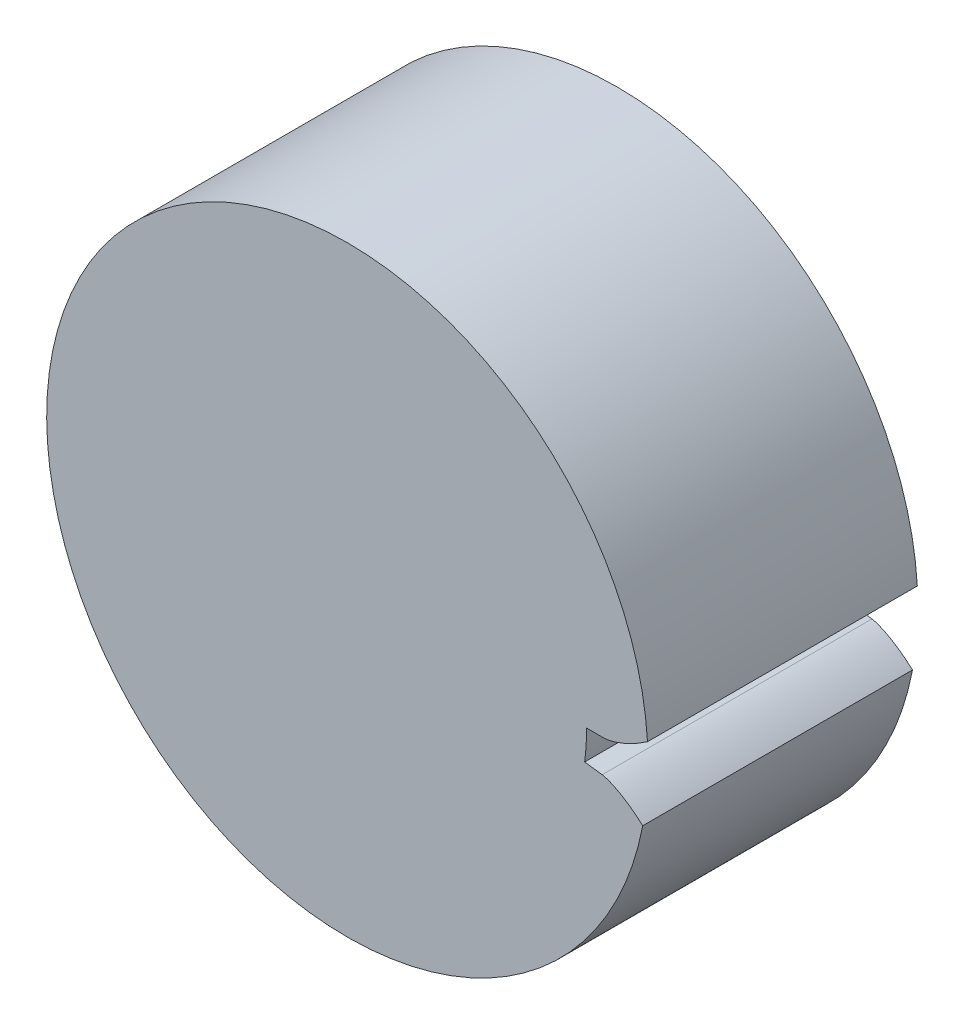
ISO-10303-21;
HEADER;
FILE_DESCRIPTION(('STEP AP214'),'2;1');
FILE_NAME('part.step','',(''),(''),'','','');
FILE_SCHEMA(('AUTOMOTIVE_DESIGN { 1 0 10303 214 1 1 1 1 }'));
ENDSEC;
DATA;
#1=APPLICATION_CONTEXT('core data for automotive mechanical design processes');
#2=APPLICATION_PROTOCOL_DEFINITION('international standard','automotive_design',2000,#1);
#3=PRODUCT_CONTEXT('',#1,'mechanical');
#4=PRODUCT('Part','Part','',(#3));
#5=PRODUCT_RELATED_PRODUCT_CATEGORY('part','',(#4));
#6=PRODUCT_DEFINITION_FORMATION('','',#4);
#7=PRODUCT_DEFINITION_CONTEXT('part definition',#1,'design');
#8=PRODUCT_DEFINITION('design','',#6,#7);
#9=PRODUCT_DEFINITION_SHAPE('','',#8);
#10=(LENGTH_UNIT() NAMED_UNIT(*) SI_UNIT(.MILLI.,.METRE.));
#11=(NAMED_UNIT(*) PLANE_ANGLE_UNIT() SI_UNIT($,.RADIAN.));
#12=(NAMED_UNIT(*) SI_UNIT($,.STERADIAN.) SOLID_ANGLE_UNIT());
#13=UNCERTAINTY_MEASURE_WITH_UNIT(LENGTH_MEASURE(1.E-05),#10,'distance_accuracy_value','');
#14=(GEOMETRIC_REPRESENTATION_CONTEXT(3) GLOBAL_UNCERTAINTY_ASSIGNED_CONTEXT((#13)) GLOBAL_UNIT_ASSIGNED_CONTEXT((#10,
#11,#12)) REPRESENTATION_CONTEXT('',''));
#15=CARTESIAN_POINT('',(0.,0.,0.));
#16=DIRECTION('',(0.,0.,1.));
#17=DIRECTION('',(1.,0.,0.));
#18=AXIS2_PLACEMENT_3D('',#15,#16,#17);
#19=CARTESIAN_POINT('',(0.,0.,22.0081524546787));
#20=DIRECTION('',(0.,0.,-1.));
#21=DIRECTION('',(-1.,0.,0.));
#22=AXIS2_PLACEMENT_3D('',#19,#20,#21);
#23=CYLINDRICAL_SURFACE('',#22,24.53);
#24=DIRECTION('',(0.,0.,-1.));
#25=VECTOR('',#24,1.);
#26=CARTESIAN_POINT('',(24.4830840405973,1.51640887001212,118.495474186672));
#27=LINE('',#26,#25);
#28=CARTESIAN_POINT('',(24.4830840405973,1.51640887001212,0.));
#29=VERTEX_POINT('',#28);
#30=CARTESIAN_POINT('',(24.4830840405973,1.51640887001212,22.0081524546787));
#31=VERTEX_POINT('',#30);
#32=EDGE_CURVE('E135',#29,#31,#27,.F.);
#33=ORIENTED_EDGE('',*,*,#32,.F.);
#34=CARTESIAN_POINT('',(0.,0.,0.));
#35=DIRECTION('',(0.,0.,1.));
#36=DIRECTION('',(1.,0.,0.));
#37=AXIS2_PLACEMENT_3D('',#34,#35,#36);
#38=CIRCLE('',#37,24.53);
#39=CARTESIAN_POINT('',(24.0925905314927,-4.61172218176972,0.));
#40=VERTEX_POINT('',#39);
#41=EDGE_CURVE('E142',#29,#40,#38,.T.);
#42=ORIENTED_EDGE('',*,*,#41,.T.);
#43=DIRECTION('',(0.,0.,-1.));
#44=VECTOR('',#43,1.);
#45=CARTESIAN_POINT('',(24.0925905314929,-4.6117221817699,118.495474186672));
#46=LINE('',#45,#44);
#47=CARTESIAN_POINT('',(24.0925905314927,-4.61172218176972,22.0081524546787));
#48=VERTEX_POINT('',#47);
#49=EDGE_CURVE('E103',#48,#40,#46,.T.);
#50=ORIENTED_EDGE('',*,*,#49,.F.);
#51=CARTESIAN_POINT('',(0.,0.,22.0081524546787));
#52=DIRECTION('',(0.,0.,1.));
#53=DIRECTION('',(1.,0.,0.));
#54=AXIS2_PLACEMENT_3D('',#51,#52,#53);
#55=CIRCLE('',#54,24.53);
#56=EDGE_CURVE('E104',#31,#48,#55,.T.);
#57=ORIENTED_EDGE('',*,*,#56,.F.);
#58=EDGE_LOOP('',(#33,#42,#50,#57));
#59=FACE_BOUND('',#58,.T.);
#60=ADVANCED_FACE('F33',(#59),#23,.T.);
#61=CARTESIAN_POINT('',(0.,0.,22.0081524546787));
#62=DIRECTION('',(0.,0.,1.));
#63=DIRECTION('',(1.,0.,0.));
#64=AXIS2_PLACEMENT_3D('',#61,#62,#63);
#65=PLANE('',#64);
#66=DIRECTION('',(1.,0.,0.));
#67=VECTOR('',#66,1.);
#68=CARTESIAN_POINT('',(0.,-9.77367946041603E-13,22.0081524546787));
#69=LINE('',#68,#67);
#70=CARTESIAN_POINT('',(19.5125000000002,-9.77412672387711E-13,22.0081524546787));
#71=VERTEX_POINT('',#70);
#72=CARTESIAN_POINT('',(20.9551454435258,0.,22.0081524546787));
#73=VERTEX_POINT('',#72);
#74=EDGE_CURVE('E49',#71,#73,#69,.T.);
#75=ORIENTED_EDGE('',*,*,#74,.T.);
#76=CARTESIAN_POINT('',(28.9552602760956,6.31103347021728,22.0081524546787));
#77=CARTESIAN_POINT('',(28.8777993206989,6.19039517992318,22.0081524546787));
#78=CARTESIAN_POINT('',(28.761641415697,6.01388314400964,22.0081524546787));
#79=CARTESIAN_POINT('',(28.5450067764435,5.69127079112527,22.0081524546787));
#80=CARTESIAN_POINT('',(28.2994710889128,5.34929477447935,22.0081524546787));
#81=CARTESIAN_POINT('',(28.000655803458,4.94289087583599,22.0081524546787));
#82=CARTESIAN_POINT('',(27.6710523241208,4.52607703143803,22.0081524546787));
#83=CARTESIAN_POINT('',(27.2581340491813,4.03259568232171,22.0081524546787));
#84=CARTESIAN_POINT('',(26.8392202342006,3.57048219914453,22.0081524546787));
#85=CARTESIAN_POINT('',(26.3970443087458,3.11438238234443,22.0081524546787));
#86=CARTESIAN_POINT('',(25.9415559930526,2.6814887369266,22.0081524546787));
#87=CARTESIAN_POINT('',(25.4664419120111,2.26386642564238,22.0081524546787));
#88=CARTESIAN_POINT('',(24.9752924333547,1.86926031210114,22.0081524546787));
#89=CARTESIAN_POINT('',(24.4748695948715,1.50299670668019,22.0081524546787));
#90=CARTESIAN_POINT('',(24.0238064651609,1.20566916431761,22.0081524546787));
#91=CARTESIAN_POINT('',(23.6275579611722,0.968289789717095,22.0081524546787));
#92=CARTESIAN_POINT('',(23.2920990554766,0.784162681570566,22.0081524546787));
#93=CARTESIAN_POINT('',(23.0109863376557,0.640889403541065,22.0081524546787));
#94=CARTESIAN_POINT('',(22.725351293716,0.507067017023368,22.0081524546787));
#95=CARTESIAN_POINT('',(22.4350681437188,0.383478515591979,22.0081524546787));
#96=CARTESIAN_POINT('',(22.1404760710558,0.271478676629855,22.0081524546787));
#97=CARTESIAN_POINT('',(21.8661839218013,0.180745878104803,22.0081524546787));
#98=CARTESIAN_POINT('',(21.6138684905812,0.109653615262727,22.0081524546787));
#99=CARTESIAN_POINT('',(21.3975994572974,0.0595320294402443,22.0081524546787));
#100=CARTESIAN_POINT('',(21.2290524347309,0.0280941351574897,22.0081524546787));
#101=CARTESIAN_POINT('',(21.0959570052681,0.00992108125252384,22.0081524546787));
#102=CARTESIAN_POINT('',(21.0140560512588,0.00226255759564043,22.0081524546787));
#103=CARTESIAN_POINT('',(20.9706376428743,0.000327831887058957,22.0081524546787));
#104=CARTESIAN_POINT('',(20.9551454435258,0.,22.0081524546787));
#105=B_SPLINE_CURVE_WITH_KNOTS('',4,(#76,#77,#78,#79,#80,#81,#82,#83,#84,#85,#86,#87,#88,#89,
#90,#91,#92,#93,#94,#95,#96,#97,#98,#99,#100,#101,#102,#103,#104),.UNSPECIFIED.,.F.,.F.,(5,1,1,
1,1,1,1,1,1,1,1,1,1,1,1,1,1,1,1,1,1,1,1,1,1,5),(0.,0.0547325075615056,0.0820986703894117,
0.109464833217318,0.164197227716701,0.21892952883394,0.273661934055029,0.328394300948438,
0.383126634698806,0.437858980006354,0.492591255964704,0.547323564788683,0.602055884128331,
0.652783570751973,0.680149902948995,0.707515960688619,0.734882062579196,0.762248420807389,
0.789614740763072,0.816980391115505,0.844236067168211,0.862480776905797,0.880559096179641,
0.894007228149373,0.903714167629343,0.909090915935218),.UNSPECIFIED.);
#106=EDGE_CURVE('E138',#73,#31,#105,.F.);
#107=ORIENTED_EDGE('',*,*,#106,.T.);
#108=ORIENTED_EDGE('',*,*,#56,.T.);
#109=CARTESIAN_POINT('',(20.7856600112579,-2.6597854153509,22.0081524546787));
#110=CARTESIAN_POINT('',(20.8009852986379,-2.66207698274439,22.0081524546787));
#111=CARTESIAN_POINT('',(20.8438069684807,-2.66950705287168,22.0081524546787));
#112=CARTESIAN_POINT('',(20.9240734290329,-2.68749912230935,22.0081524546787));
#113=CARTESIAN_POINT('',(21.0537857199573,-2.72241867006161,22.0081524546787));
#114=CARTESIAN_POINT('',(21.216979197354,-2.77499555612635,22.0081524546787));
#115=CARTESIAN_POINT('',(21.4251372340319,-2.85216225807118,22.0081524546787));
#116=CARTESIAN_POINT('',(21.666388368209,-2.95470530720844,22.0081524546787));
#117=CARTESIAN_POINT('',(21.9269455472871,-3.07951949030218,22.0081524546787));
#118=CARTESIAN_POINT('',(22.2049390903003,-3.228005325474,22.0081524546787));
#119=CARTESIAN_POINT('',(22.477187640643,-3.38743917286688,22.0081524546787));
#120=CARTESIAN_POINT('',(22.7435267168269,-3.556434160832,22.0081524546787));
#121=CARTESIAN_POINT('',(23.004180464942,-3.73422959359527,22.0081524546787));
#122=CARTESIAN_POINT('',(23.3135553715581,-3.95944645912975,22.0081524546787));
#123=CARTESIAN_POINT('',(23.6764690294904,-4.24520076143369,22.0081524546787));
#124=CARTESIAN_POINT('',(24.086144897413,-4.59737585662598,22.0081524546787));
#125=CARTESIAN_POINT('',(24.5360313662094,-5.02419456653107,22.0081524546787));
#126=CARTESIAN_POINT('',(24.9731220328977,-5.47794950515221,22.0081524546787));
#127=CARTESIAN_POINT('',(25.391385606683,-5.95249915242844,22.0081524546787));
#128=CARTESIAN_POINT('',(25.7882437953817,-6.43970556868316,22.0081524546787));
#129=CARTESIAN_POINT('',(26.1689517619513,-6.94824075539722,22.0081524546787));
#130=CARTESIAN_POINT('',(26.5258224622572,-7.45978836704266,22.0081524546787));
#131=CARTESIAN_POINT('',(26.8727646679206,-8.00168914175421,22.0081524546787));
#132=CARTESIAN_POINT('',(27.1467971479757,-8.45696755585763,22.0081524546787));
#133=CARTESIAN_POINT('',(27.3916117583582,-8.89801234972425,22.0081524546787));
#134=CARTESIAN_POINT('',(27.5917553704118,-9.26838770577066,22.0081524546787));
#135=CARTESIAN_POINT('',(27.7656894686976,-9.61588767211816,22.0081524546787));
#136=CARTESIAN_POINT('',(27.8585036458874,-9.80571571596142,22.0081524546787));
#137=CARTESIAN_POINT('',(27.9200257728247,-9.93521021234319,22.0081524546787));
#138=B_SPLINE_CURVE_WITH_KNOTS('',4,(#109,#110,#111,#112,#113,#114,#115,#116,#117,#118,#119,
#120,#121,#122,#123,#124,#125,#126,#127,#128,#129,#130,#131,#132,#133,#134,#135,#136,#137),
.UNSPECIFIED.,.F.,.F.,(5,1,1,1,1,1,1,1,1,1,1,1,1,1,1,1,1,1,1,1,1,1,1,1,1,5),(0.,
0.00537674830587566,0.0150836877858451,0.0285318197555767,0.0466101390294211,0.0648548487670067,
0.0921105248197128,0.119476175172146,0.146842495127828,0.174208853356021,0.201574955246598,
0.228941012986221,0.256307345183243,0.307035031806885,0.361767351146533,0.416499659970511,
0.471231935928861,0.525964281236409,0.580696614986776,0.635428981880185,0.690161387101273,
0.744893688218513,0.799626082717896,0.826992245545801,0.854358408373706,0.909090915935212),.UNSPECIFIED.);
#139=CARTESIAN_POINT('',(20.7856600112579,-2.6597854153509,22.0081524546787));
#140=VERTEX_POINT('',#139);
#141=EDGE_CURVE('E125',#48,#140,#138,.F.);
#142=ORIENTED_EDGE('',*,*,#141,.T.);
#143=DIRECTION('',(-0.991911989696062,0.126927556886592,0.));
#144=VECTOR('',#143,1.);
#145=CARTESIAN_POINT('',(-1.24844448589306E-13,-9.75632939294429E-13,22.0081524546787));
#146=LINE('',#145,#144);
#147=CARTESIAN_POINT('',(19.3546826989446,-2.47667395375064,22.0081524546787));
#148=VERTEX_POINT('',#147);
#149=EDGE_CURVE('E108',#140,#148,#146,.T.);
#150=ORIENTED_EDGE('',*,*,#149,.T.);
#151=CARTESIAN_POINT('',(0.,-9.77412672387711E-13,22.0081524546787));
#152=DIRECTION('',(0.,0.,1.));
#153=DIRECTION('',(1.,0.,0.));
#154=AXIS2_PLACEMENT_3D('',#151,#152,#153);
#155=CIRCLE('',#154,19.5125000000001);
#156=EDGE_CURVE('E54',#148,#71,#155,.T.);
#157=ORIENTED_EDGE('',*,*,#156,.T.);
#158=EDGE_LOOP('',(#75,#107,#108,#142,#150,#157));
#159=FACE_BOUND('',#158,.T.);
#160=ADVANCED_FACE('F162',(#159),#65,.T.);
#161=CARTESIAN_POINT('',(0.,0.,0.));
#162=DIRECTION('',(0.,0.,1.));
#163=DIRECTION('',(1.,0.,0.));
#164=AXIS2_PLACEMENT_3D('',#161,#162,#163);
#165=PLANE('',#164);
#166=CARTESIAN_POINT('',(28.9552602760956,6.31103347021728,0.));
#167=CARTESIAN_POINT('',(28.8777993206989,6.19039517992318,0.));
#168=CARTESIAN_POINT('',(28.761641415697,6.01388314400964,0.));
#169=CARTESIAN_POINT('',(28.5450067764435,5.69127079112527,0.));
#170=CARTESIAN_POINT('',(28.2994710889128,5.34929477447935,0.));
#171=CARTESIAN_POINT('',(28.000655803458,4.94289087583599,0.));
#172=CARTESIAN_POINT('',(27.6710523241208,4.52607703143803,0.));
#173=CARTESIAN_POINT('',(27.2581340491813,4.03259568232171,0.));
#174=CARTESIAN_POINT('',(26.8392202342006,3.57048219914453,0.));
#175=CARTESIAN_POINT('',(26.3970443087458,3.11438238234443,0.));
#176=CARTESIAN_POINT('',(25.9415559930526,2.6814887369266,0.));
#177=CARTESIAN_POINT('',(25.4664419120111,2.26386642564238,0.));
#178=CARTESIAN_POINT('',(24.9752924333547,1.86926031210114,0.));
#179=CARTESIAN_POINT('',(24.4748695948715,1.50299670668019,0.));
#180=CARTESIAN_POINT('',(24.0238064651609,1.20566916431761,0.));
#181=CARTESIAN_POINT('',(23.6275579611722,0.968289789717095,0.));
#182=CARTESIAN_POINT('',(23.2920990554766,0.784162681570566,0.));
#183=CARTESIAN_POINT('',(23.0109863376557,0.640889403541065,0.));
#184=CARTESIAN_POINT('',(22.725351293716,0.507067017023368,0.));
#185=CARTESIAN_POINT('',(22.4350681437188,0.383478515591979,0.));
#186=CARTESIAN_POINT('',(22.1404760710558,0.271478676629855,0.));
#187=CARTESIAN_POINT('',(21.8661839218013,0.180745878104803,0.));
#188=CARTESIAN_POINT('',(21.6138684905812,0.109653615262727,0.));
#189=CARTESIAN_POINT('',(21.3975994572974,0.0595320294402443,0.));
#190=CARTESIAN_POINT('',(21.2290524347309,0.0280941351574897,0.));
#191=CARTESIAN_POINT('',(21.0959570052681,0.00992108125252384,0.));
#192=CARTESIAN_POINT('',(21.0140560512588,0.00226255759564043,0.));
#193=CARTESIAN_POINT('',(20.9706376428743,0.000327831887058957,0.));
#194=CARTESIAN_POINT('',(20.9551454435258,0.,0.));
#195=B_SPLINE_CURVE_WITH_KNOTS('',4,(#166,#167,#168,#169,#170,#171,#172,#173,#174,#175,#176,
#177,#178,#179,#180,#181,#182,#183,#184,#185,#186,#187,#188,#189,#190,#191,#192,#193,#194),
.UNSPECIFIED.,.F.,.F.,(5,1,1,1,1,1,1,1,1,1,1,1,1,1,1,1,1,1,1,1,1,1,1,1,1,5),(0.,
0.0547325075615056,0.0820986703894117,0.109464833217318,0.164197227716701,0.21892952883394,
0.273661934055029,0.328394300948438,0.383126634698806,0.437858980006354,0.492591255964704,
0.547323564788683,0.602055884128331,0.652783570751973,0.680149902948995,0.707515960688619,
0.734882062579196,0.762248420807389,0.789614740763072,0.816980391115505,0.844236067168211,
0.862480776905797,0.880559096179641,0.894007228149373,0.903714167629343,0.909090915935218),.UNSPECIFIED.);
#196=CARTESIAN_POINT('',(20.9551454435258,0.,0.));
#197=VERTEX_POINT('',#196);
#198=EDGE_CURVE('E11',#197,#29,#195,.F.);
#199=ORIENTED_EDGE('',*,*,#198,.F.);
#200=DIRECTION('',(1.,0.,0.));
#201=VECTOR('',#200,1.);
#202=CARTESIAN_POINT('',(0.,-9.77367946041603E-13,0.));
#203=LINE('',#202,#201);
#204=CARTESIAN_POINT('',(19.5125000000002,-9.77412672387711E-13,0.));
#205=VERTEX_POINT('',#204);
#206=EDGE_CURVE('E42',#205,#197,#203,.T.);
#207=ORIENTED_EDGE('',*,*,#206,.F.);
#208=CARTESIAN_POINT('',(0.,-9.77412672387711E-13,0.));
#209=DIRECTION('',(0.,0.,1.));
#210=DIRECTION('',(1.,0.,0.));
#211=AXIS2_PLACEMENT_3D('',#208,#209,#210);
#212=CIRCLE('',#211,19.5125000000001);
#213=CARTESIAN_POINT('',(19.3546826989446,-2.47667395375064,0.));
#214=VERTEX_POINT('',#213);
#215=EDGE_CURVE('E91',#214,#205,#212,.T.);
#216=ORIENTED_EDGE('',*,*,#215,.F.);
#217=DIRECTION('',(-0.991911989696062,0.126927556886592,0.));
#218=VECTOR('',#217,1.);
#219=CARTESIAN_POINT('',(-1.24844448589306E-13,-9.75632939294429E-13,0.));
#220=LINE('',#219,#218);
#221=CARTESIAN_POINT('',(20.7856600112579,-2.6597854153509,0.));
#222=VERTEX_POINT('',#221);
#223=EDGE_CURVE('E84',#222,#214,#220,.T.);
#224=ORIENTED_EDGE('',*,*,#223,.F.);
#225=CARTESIAN_POINT('',(20.7856600112579,-2.6597854153509,0.));
#226=CARTESIAN_POINT('',(20.8009852986379,-2.66207698274439,0.));
#227=CARTESIAN_POINT('',(20.8438069684807,-2.66950705287168,0.));
#228=CARTESIAN_POINT('',(20.9240734290329,-2.68749912230935,0.));
#229=CARTESIAN_POINT('',(21.0537857199573,-2.72241867006161,0.));
#230=CARTESIAN_POINT('',(21.216979197354,-2.77499555612635,0.));
#231=CARTESIAN_POINT('',(21.4251372340319,-2.85216225807118,0.));
#232=CARTESIAN_POINT('',(21.666388368209,-2.95470530720844,0.));
#233=CARTESIAN_POINT('',(21.9269455472871,-3.07951949030218,0.));
#234=CARTESIAN_POINT('',(22.2049390903003,-3.228005325474,0.));
#235=CARTESIAN_POINT('',(22.477187640643,-3.38743917286688,0.));
#236=CARTESIAN_POINT('',(22.7435267168269,-3.556434160832,0.));
#237=CARTESIAN_POINT('',(23.004180464942,-3.73422959359527,0.));
#238=CARTESIAN_POINT('',(23.3135553715581,-3.95944645912975,0.));
#239=CARTESIAN_POINT('',(23.6764690294904,-4.24520076143369,0.));
#240=CARTESIAN_POINT('',(24.086144897413,-4.59737585662598,0.));
#241=CARTESIAN_POINT('',(24.5360313662094,-5.02419456653107,0.));
#242=CARTESIAN_POINT('',(24.9731220328977,-5.47794950515221,0.));
#243=CARTESIAN_POINT('',(25.391385606683,-5.95249915242844,0.));
#244=CARTESIAN_POINT('',(25.7882437953817,-6.43970556868316,0.));
#245=CARTESIAN_POINT('',(26.1689517619513,-6.94824075539722,0.));
#246=CARTESIAN_POINT('',(26.5258224622572,-7.45978836704266,0.));
#247=CARTESIAN_POINT('',(26.8727646679206,-8.00168914175421,0.));
#248=CARTESIAN_POINT('',(27.1467971479757,-8.45696755585763,0.));
#249=CARTESIAN_POINT('',(27.3916117583582,-8.89801234972425,0.));
#250=CARTESIAN_POINT('',(27.5917553704118,-9.26838770577066,0.));
#251=CARTESIAN_POINT('',(27.7656894686976,-9.61588767211816,0.));
#252=CARTESIAN_POINT('',(27.8585036458874,-9.80571571596142,0.));
#253=CARTESIAN_POINT('',(27.9200257728247,-9.93521021234319,0.));
#254=B_SPLINE_CURVE_WITH_KNOTS('',4,(#225,#226,#227,#228,#229,#230,#231,#232,#233,#234,#235,
#236,#237,#238,#239,#240,#241,#242,#243,#244,#245,#246,#247,#248,#249,#250,#251,#252,#253),
.UNSPECIFIED.,.F.,.F.,(5,1,1,1,1,1,1,1,1,1,1,1,1,1,1,1,1,1,1,1,1,1,1,1,1,5),(0.,
0.00537674830587566,0.0150836877858451,0.0285318197555767,0.0466101390294211,0.0648548487670067,
0.0921105248197128,0.119476175172146,0.146842495127828,0.174208853356021,0.201574955246598,
0.228941012986221,0.256307345183243,0.307035031806885,0.361767351146533,0.416499659970511,
0.471231935928861,0.525964281236409,0.580696614986776,0.635428981880185,0.690161387101273,
0.744893688218513,0.799626082717896,0.826992245545801,0.854358408373706,0.909090915935212),.UNSPECIFIED.);
#255=EDGE_CURVE('E88',#40,#222,#254,.F.);
#256=ORIENTED_EDGE('',*,*,#255,.F.);
#257=ORIENTED_EDGE('',*,*,#41,.F.);
#258=EDGE_LOOP('',(#199,#207,#216,#224,#256,#257));
#259=FACE_BOUND('',#258,.T.);
#260=ADVANCED_FACE('F86',(#259),#165,.F.);
#261=CARTESIAN_POINT('',(19.5125,0.,118.495474186672));
#262=DIRECTION('',(0.,-1.,0.));
#263=DIRECTION('',(1.,0.,0.));
#264=AXIS2_PLACEMENT_3D('',#261,#262,#263);
#265=PLANE('',#264);
#266=ORIENTED_EDGE('',*,*,#74,.F.);
#267=DIRECTION('',(0.,0.,-1.));
#268=VECTOR('',#267,1.);
#269=CARTESIAN_POINT('',(19.5125,0.,118.495474186672));
#270=LINE('',#269,#268);
#271=EDGE_CURVE('E111',#71,#205,#270,.T.);
#272=ORIENTED_EDGE('',*,*,#271,.T.);
#273=ORIENTED_EDGE('',*,*,#206,.T.);
#274=DIRECTION('',(0.,0.,-1.));
#275=VECTOR('',#274,1.);
#276=CARTESIAN_POINT('',(20.9551454435258,0.,118.495474186672));
#277=LINE('',#276,#275);
#278=EDGE_CURVE('E121',#73,#197,#277,.T.);
#279=ORIENTED_EDGE('',*,*,#278,.F.);
#280=EDGE_LOOP('',(#266,#272,#273,#279));
#281=FACE_BOUND('',#280,.T.);
#282=ADVANCED_FACE('F157',(#281),#265,.T.);
#283=CARTESIAN_POINT('',(0.,-9.77412672387711E-13,118.495474186672));
#284=DIRECTION('',(0.,0.,-1.));
#285=DIRECTION('',(-1.,0.,0.));
#286=AXIS2_PLACEMENT_3D('',#283,#284,#285);
#287=CYLINDRICAL_SURFACE('',#286,19.5125000000001);
#288=ORIENTED_EDGE('',*,*,#156,.F.);
#289=DIRECTION('',(0.,0.,-1.));
#290=VECTOR('',#289,1.);
#291=CARTESIAN_POINT('',(19.3546826989446,-2.47667395375065,118.495474186672));
#292=LINE('',#291,#290);
#293=EDGE_CURVE('E109',#148,#214,#292,.T.);
#294=ORIENTED_EDGE('',*,*,#293,.T.);
#295=ORIENTED_EDGE('',*,*,#215,.T.);
#296=ORIENTED_EDGE('',*,*,#271,.F.);
#297=EDGE_LOOP('',(#288,#294,#295,#296));
#298=FACE_BOUND('',#297,.T.);
#299=ADVANCED_FACE('F177',(#298),#287,.T.);
#300=CARTESIAN_POINT('',(19.3546826989447,-2.47667395375066,118.495474186672));
#301=DIRECTION('',(0.126927556886592,0.991911989696062,0.));
#302=DIRECTION('',(-0.991911989696062,0.126927556886592,0.));
#303=AXIS2_PLACEMENT_3D('',#300,#301,#302);
#304=PLANE('',#303);
#305=ORIENTED_EDGE('',*,*,#149,.F.);
#306=DIRECTION('',(0.,0.,-1.));
#307=VECTOR('',#306,1.);
#308=CARTESIAN_POINT('',(20.7856600112579,-2.6597854153509,118.495474186672));
#309=LINE('',#308,#307);
#310=EDGE_CURVE('E102',#140,#222,#309,.T.);
#311=ORIENTED_EDGE('',*,*,#310,.T.);
#312=ORIENTED_EDGE('',*,*,#223,.T.);
#313=ORIENTED_EDGE('',*,*,#293,.F.);
#314=EDGE_LOOP('',(#305,#311,#312,#313));
#315=FACE_BOUND('',#314,.T.);
#316=ADVANCED_FACE('F107',(#315),#304,.T.);
#317=CARTESIAN_POINT('',(28.9552602760956,6.31103347021728,118.495474186672));
#318=CARTESIAN_POINT('',(28.8777993206989,6.19039517992318,118.495474186672));
#319=CARTESIAN_POINT('',(28.761641415697,6.01388314400964,118.495474186672));
#320=CARTESIAN_POINT('',(28.5450067764435,5.69127079112527,118.495474186672));
#321=CARTESIAN_POINT('',(28.2994710889128,5.34929477447935,118.495474186672));
#322=CARTESIAN_POINT('',(28.000655803458,4.94289087583599,118.495474186672));
#323=CARTESIAN_POINT('',(27.6710523241208,4.52607703143803,118.495474186672));
#324=CARTESIAN_POINT('',(27.2581340491813,4.03259568232171,118.495474186672));
#325=CARTESIAN_POINT('',(26.8392202342006,3.57048219914453,118.495474186672));
#326=CARTESIAN_POINT('',(26.3970443087458,3.11438238234443,118.495474186672));
#327=CARTESIAN_POINT('',(25.9415559930526,2.6814887369266,118.495474186672));
#328=CARTESIAN_POINT('',(25.4664419120111,2.26386642564238,118.495474186672));
#329=CARTESIAN_POINT('',(24.9752924333547,1.86926031210114,118.495474186672));
#330=CARTESIAN_POINT('',(24.4748695948715,1.50299670668019,118.495474186672));
#331=CARTESIAN_POINT('',(24.0238064651609,1.20566916431761,118.495474186672));
#332=CARTESIAN_POINT('',(23.6275579611722,0.968289789717095,118.495474186672));
#333=CARTESIAN_POINT('',(23.2920990554766,0.784162681570566,118.495474186672));
#334=CARTESIAN_POINT('',(23.0109863376557,0.640889403541065,118.495474186672));
#335=CARTESIAN_POINT('',(22.725351293716,0.507067017023368,118.495474186672));
#336=CARTESIAN_POINT('',(22.4350681437188,0.383478515591979,118.495474186672));
#337=CARTESIAN_POINT('',(22.1404760710558,0.271478676629855,118.495474186672));
#338=CARTESIAN_POINT('',(21.8661839218013,0.180745878104803,118.495474186672));
#339=CARTESIAN_POINT('',(21.6138684905812,0.109653615262727,118.495474186672));
#340=CARTESIAN_POINT('',(21.3975994572974,0.0595320294402443,118.495474186672));
#341=CARTESIAN_POINT('',(21.2290524347309,0.0280941351574897,118.495474186672));
#342=CARTESIAN_POINT('',(21.0959570052681,0.00992108125252384,118.495474186672));
#343=CARTESIAN_POINT('',(21.0140560512588,0.00226255759564043,118.495474186672));
#344=CARTESIAN_POINT('',(20.9706376428743,0.000327831887058957,118.495474186672));
#345=CARTESIAN_POINT('',(20.9551454435258,0.,118.495474186672));
#346=B_SPLINE_CURVE_WITH_KNOTS('',4,(#317,#318,#319,#320,#321,#322,#323,#324,#325,#326,#327,
#328,#329,#330,#331,#332,#333,#334,#335,#336,#337,#338,#339,#340,#341,#342,#343,#344,#345),
.UNSPECIFIED.,.F.,.F.,(5,1,1,1,1,1,1,1,1,1,1,1,1,1,1,1,1,1,1,1,1,1,1,1,1,5),(0.,
0.0547325075615056,0.0820986703894117,0.109464833217318,0.164197227716701,0.21892952883394,
0.273661934055029,0.328394300948438,0.383126634698806,0.437858980006354,0.492591255964704,
0.547323564788683,0.602055884128331,0.652783570751973,0.680149902948995,0.707515960688619,
0.734882062579196,0.762248420807389,0.789614740763072,0.816980391115505,0.844236067168211,
0.862480776905797,0.880559096179641,0.894007228149373,0.903714167629343,0.909090915935218),.UNSPECIFIED.);
#347=DIRECTION('',(0.,0.,-1.));
#348=VECTOR('',#347,1.);
#349=SURFACE_OF_LINEAR_EXTRUSION('',#346,#348);
#350=ORIENTED_EDGE('',*,*,#106,.F.);
#351=ORIENTED_EDGE('',*,*,#278,.T.);
#352=ORIENTED_EDGE('',*,*,#198,.T.);
#353=ORIENTED_EDGE('',*,*,#32,.T.);
#354=EDGE_LOOP('',(#350,#351,#352,#353));
#355=FACE_BOUND('',#354,.T.);
#356=ADVANCED_FACE('F160',(#355),#349,.T.);
#357=CARTESIAN_POINT('',(20.7856600112579,-2.6597854153509,118.495474186672));
#358=CARTESIAN_POINT('',(20.8009852986379,-2.66207698274439,118.495474186672));
#359=CARTESIAN_POINT('',(20.8438069684807,-2.66950705287168,118.495474186672));
#360=CARTESIAN_POINT('',(20.9240734290329,-2.68749912230935,118.495474186672));
#361=CARTESIAN_POINT('',(21.0537857199573,-2.72241867006161,118.495474186672));
#362=CARTESIAN_POINT('',(21.216979197354,-2.77499555612635,118.495474186672));
#363=CARTESIAN_POINT('',(21.4251372340319,-2.85216225807118,118.495474186672));
#364=CARTESIAN_POINT('',(21.666388368209,-2.95470530720844,118.495474186672));
#365=CARTESIAN_POINT('',(21.9269455472871,-3.07951949030218,118.495474186672));
#366=CARTESIAN_POINT('',(22.2049390903003,-3.228005325474,118.495474186672));
#367=CARTESIAN_POINT('',(22.477187640643,-3.38743917286688,118.495474186672));
#368=CARTESIAN_POINT('',(22.7435267168269,-3.556434160832,118.495474186672));
#369=CARTESIAN_POINT('',(23.004180464942,-3.73422959359527,118.495474186672));
#370=CARTESIAN_POINT('',(23.3135553715581,-3.95944645912975,118.495474186672));
#371=CARTESIAN_POINT('',(23.6764690294904,-4.24520076143369,118.495474186672));
#372=CARTESIAN_POINT('',(24.086144897413,-4.59737585662598,118.495474186672));
#373=CARTESIAN_POINT('',(24.5360313662094,-5.02419456653107,118.495474186672));
#374=CARTESIAN_POINT('',(24.9731220328977,-5.47794950515221,118.495474186672));
#375=CARTESIAN_POINT('',(25.391385606683,-5.95249915242844,118.495474186672));
#376=CARTESIAN_POINT('',(25.7882437953817,-6.43970556868316,118.495474186672));
#377=CARTESIAN_POINT('',(26.1689517619513,-6.94824075539722,118.495474186672));
#378=CARTESIAN_POINT('',(26.5258224622572,-7.45978836704266,118.495474186672));
#379=CARTESIAN_POINT('',(26.8727646679206,-8.00168914175421,118.495474186672));
#380=CARTESIAN_POINT('',(27.1467971479757,-8.45696755585763,118.495474186672));
#381=CARTESIAN_POINT('',(27.3916117583582,-8.89801234972425,118.495474186672));
#382=CARTESIAN_POINT('',(27.5917553704118,-9.26838770577066,118.495474186672));
#383=CARTESIAN_POINT('',(27.7656894686976,-9.61588767211816,118.495474186672));
#384=CARTESIAN_POINT('',(27.8585036458874,-9.80571571596142,118.495474186672));
#385=CARTESIAN_POINT('',(27.9200257728247,-9.93521021234319,118.495474186672));
#386=B_SPLINE_CURVE_WITH_KNOTS('',4,(#357,#358,#359,#360,#361,#362,#363,#364,#365,#366,#367,
#368,#369,#370,#371,#372,#373,#374,#375,#376,#377,#378,#379,#380,#381,#382,#383,#384,#385),
.UNSPECIFIED.,.F.,.F.,(5,1,1,1,1,1,1,1,1,1,1,1,1,1,1,1,1,1,1,1,1,1,1,1,1,5),(0.,
0.00537674830587566,0.0150836877858451,0.0285318197555767,0.0466101390294211,0.0648548487670067,
0.0921105248197128,0.119476175172146,0.146842495127828,0.174208853356021,0.201574955246598,
0.228941012986221,0.256307345183243,0.307035031806885,0.361767351146533,0.416499659970511,
0.471231935928861,0.525964281236409,0.580696614986776,0.635428981880185,0.690161387101273,
0.744893688218513,0.799626082717896,0.826992245545801,0.854358408373706,0.909090915935212),.UNSPECIFIED.);
#387=DIRECTION('',(0.,0.,-1.));
#388=VECTOR('',#387,1.);
#389=SURFACE_OF_LINEAR_EXTRUSION('',#386,#388);
#390=ORIENTED_EDGE('',*,*,#141,.F.);
#391=ORIENTED_EDGE('',*,*,#49,.T.);
#392=ORIENTED_EDGE('',*,*,#255,.T.);
#393=ORIENTED_EDGE('',*,*,#310,.F.);
#394=EDGE_LOOP('',(#390,#391,#392,#393));
#395=FACE_BOUND('',#394,.T.);
#396=ADVANCED_FACE('F101',(#395),#389,.T.);
#397=CLOSED_SHELL('',(#60,#160,#260,#282,#299,#316,#356,#396));
#398=MANIFOLD_SOLID_BREP('B2',#397);
#399=ADVANCED_BREP_SHAPE_REPRESENTATION('',(#18,#398),#14);
#400=SHAPE_DEFINITION_REPRESENTATION(#9,#399);
ENDSEC;
END-ISO-10303-21;
